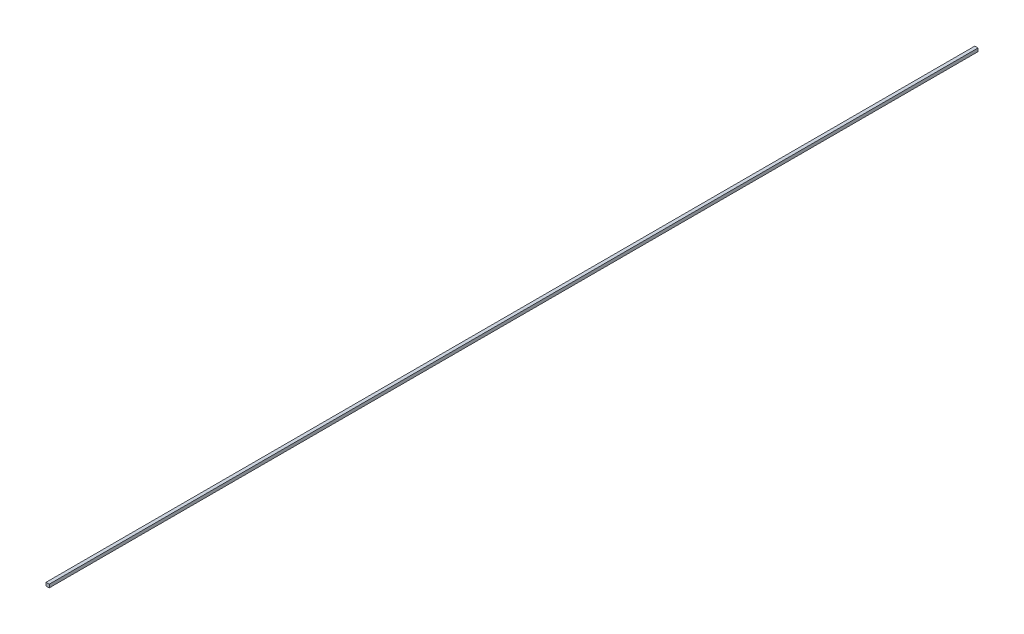
ISO-10303-21;
HEADER;
FILE_DESCRIPTION(('STEP AP214'),'2;1');
FILE_NAME('part.step','',(''),(''),'','','');
FILE_SCHEMA(('AUTOMOTIVE_DESIGN { 1 0 10303 214 1 1 1 1 }'));
ENDSEC;
DATA;
#1=APPLICATION_CONTEXT('core data for automotive mechanical design processes');
#2=APPLICATION_PROTOCOL_DEFINITION('international standard','automotive_design',2000,#1);
#3=PRODUCT_CONTEXT('',#1,'mechanical');
#4=PRODUCT('Part','Part','',(#3));
#5=PRODUCT_RELATED_PRODUCT_CATEGORY('part','',(#4));
#6=PRODUCT_DEFINITION_FORMATION('','',#4);
#7=PRODUCT_DEFINITION_CONTEXT('part definition',#1,'design');
#8=PRODUCT_DEFINITION('design','',#6,#7);
#9=PRODUCT_DEFINITION_SHAPE('','',#8);
#10=(LENGTH_UNIT() NAMED_UNIT(*) SI_UNIT(.MILLI.,.METRE.));
#11=(NAMED_UNIT(*) PLANE_ANGLE_UNIT() SI_UNIT($,.RADIAN.));
#12=(NAMED_UNIT(*) SI_UNIT($,.STERADIAN.) SOLID_ANGLE_UNIT());
#13=UNCERTAINTY_MEASURE_WITH_UNIT(LENGTH_MEASURE(1.E-05),#10,'distance_accuracy_value','');
#14=(GEOMETRIC_REPRESENTATION_CONTEXT(3) GLOBAL_UNCERTAINTY_ASSIGNED_CONTEXT((#13)) GLOBAL_UNIT_ASSIGNED_CONTEXT((#10,
#11,#12)) REPRESENTATION_CONTEXT('',''));
#15=CARTESIAN_POINT('',(0.,0.,0.));
#16=DIRECTION('',(0.,0.,1.));
#17=DIRECTION('',(1.,0.,0.));
#18=AXIS2_PLACEMENT_3D('',#15,#16,#17);
#19=CARTESIAN_POINT('',(0.175,0.175,100.));
#20=DIRECTION('',(-1.,0.,0.));
#21=DIRECTION('',(0.,-1.,0.));
#22=AXIS2_PLACEMENT_3D('',#19,#20,#21);
#23=PLANE('',#22);
#24=DIRECTION('',(0.,1.,0.));
#25=VECTOR('',#24,1.);
#26=CARTESIAN_POINT('',(0.175,0.175,0.));
#27=LINE('',#26,#25);
#28=CARTESIAN_POINT('',(0.175,-0.175,0.));
#29=VERTEX_POINT('',#28);
#30=CARTESIAN_POINT('',(0.175,0.175,0.));
#31=VERTEX_POINT('',#30);
#32=EDGE_CURVE('E98',#29,#31,#27,.T.);
#33=ORIENTED_EDGE('',*,*,#32,.T.);
#34=DIRECTION('',(0.,0.,-1.));
#35=VECTOR('',#34,1.);
#36=CARTESIAN_POINT('',(0.175,0.175,100.));
#37=LINE('',#36,#35);
#38=CARTESIAN_POINT('',(0.175,0.175,100.));
#39=VERTEX_POINT('',#38);
#40=EDGE_CURVE('E11',#39,#31,#37,.T.);
#41=ORIENTED_EDGE('',*,*,#40,.F.);
#42=DIRECTION('',(0.,1.,0.));
#43=VECTOR('',#42,1.);
#44=CARTESIAN_POINT('',(0.175,0.175,100.));
#45=LINE('',#44,#43);
#46=CARTESIAN_POINT('',(0.175,-0.175,100.));
#47=VERTEX_POINT('',#46);
#48=EDGE_CURVE('E86',#47,#39,#45,.T.);
#49=ORIENTED_EDGE('',*,*,#48,.F.);
#50=DIRECTION('',(0.,0.,-1.));
#51=VECTOR('',#50,1.);
#52=CARTESIAN_POINT('',(0.175,-0.175,100.));
#53=LINE('',#52,#51);
#54=EDGE_CURVE('E94',#47,#29,#53,.T.);
#55=ORIENTED_EDGE('',*,*,#54,.T.);
#56=EDGE_LOOP('',(#33,#41,#49,#55));
#57=FACE_BOUND('',#56,.T.);
#58=ADVANCED_FACE('F35',(#57),#23,.F.);
#59=CARTESIAN_POINT('',(-0.175,0.175,100.));
#60=DIRECTION('',(0.,-1.,0.));
#61=DIRECTION('',(0.,0.,-1.));
#62=AXIS2_PLACEMENT_3D('',#59,#60,#61);
#63=PLANE('',#62);
#64=DIRECTION('',(-1.,0.,0.));
#65=VECTOR('',#64,1.);
#66=CARTESIAN_POINT('',(-0.175,0.175,0.));
#67=LINE('',#66,#65);
#68=CARTESIAN_POINT('',(-0.175,0.175,0.));
#69=VERTEX_POINT('',#68);
#70=EDGE_CURVE('E90',#31,#69,#67,.T.);
#71=ORIENTED_EDGE('',*,*,#70,.T.);
#72=DIRECTION('',(0.,0.,-1.));
#73=VECTOR('',#72,1.);
#74=CARTESIAN_POINT('',(-0.175,0.175,100.));
#75=LINE('',#74,#73);
#76=CARTESIAN_POINT('',(-0.175,0.175,100.));
#77=VERTEX_POINT('',#76);
#78=EDGE_CURVE('E43',#77,#69,#75,.T.);
#79=ORIENTED_EDGE('',*,*,#78,.F.);
#80=DIRECTION('',(-1.,0.,0.));
#81=VECTOR('',#80,1.);
#82=CARTESIAN_POINT('',(-0.175,0.175,100.));
#83=LINE('',#82,#81);
#84=EDGE_CURVE('E81',#39,#77,#83,.T.);
#85=ORIENTED_EDGE('',*,*,#84,.F.);
#86=ORIENTED_EDGE('',*,*,#40,.T.);
#87=EDGE_LOOP('',(#71,#79,#85,#86));
#88=FACE_BOUND('',#87,.T.);
#89=ADVANCED_FACE('F89',(#88),#63,.F.);
#90=CARTESIAN_POINT('',(-0.175,0.175,100.));
#91=DIRECTION('',(1.,0.,0.));
#92=DIRECTION('',(0.,1.,0.));
#93=AXIS2_PLACEMENT_3D('',#90,#91,#92);
#94=PLANE('',#93);
#95=DIRECTION('',(0.,-1.,0.));
#96=VECTOR('',#95,1.);
#97=CARTESIAN_POINT('',(-0.175,0.175,0.));
#98=LINE('',#97,#96);
#99=CARTESIAN_POINT('',(-0.175,-0.175,0.));
#100=VERTEX_POINT('',#99);
#101=EDGE_CURVE('E68',#69,#100,#98,.T.);
#102=ORIENTED_EDGE('',*,*,#101,.T.);
#103=DIRECTION('',(0.,0.,-1.));
#104=VECTOR('',#103,1.);
#105=CARTESIAN_POINT('',(-0.175,-0.175,100.));
#106=LINE('',#105,#104);
#107=CARTESIAN_POINT('',(-0.175,-0.175,100.));
#108=VERTEX_POINT('',#107);
#109=EDGE_CURVE('E91',#108,#100,#106,.T.);
#110=ORIENTED_EDGE('',*,*,#109,.F.);
#111=DIRECTION('',(0.,-1.,0.));
#112=VECTOR('',#111,1.);
#113=CARTESIAN_POINT('',(-0.175,0.175,100.));
#114=LINE('',#113,#112);
#115=EDGE_CURVE('E84',#77,#108,#114,.T.);
#116=ORIENTED_EDGE('',*,*,#115,.F.);
#117=ORIENTED_EDGE('',*,*,#78,.T.);
#118=EDGE_LOOP('',(#102,#110,#116,#117));
#119=FACE_BOUND('',#118,.T.);
#120=ADVANCED_FACE('F92',(#119),#94,.F.);
#121=CARTESIAN_POINT('',(-0.175,-0.175,100.));
#122=DIRECTION('',(0.,1.,0.));
#123=DIRECTION('',(-1.,0.,0.));
#124=AXIS2_PLACEMENT_3D('',#121,#122,#123);
#125=PLANE('',#124);
#126=DIRECTION('',(1.,0.,0.));
#127=VECTOR('',#126,1.);
#128=CARTESIAN_POINT('',(-0.175,-0.175,0.));
#129=LINE('',#128,#127);
#130=EDGE_CURVE('E74',#100,#29,#129,.T.);
#131=ORIENTED_EDGE('',*,*,#130,.T.);
#132=ORIENTED_EDGE('',*,*,#54,.F.);
#133=DIRECTION('',(1.,0.,0.));
#134=VECTOR('',#133,1.);
#135=CARTESIAN_POINT('',(-0.175,-0.175,100.));
#136=LINE('',#135,#134);
#137=EDGE_CURVE('E51',#108,#47,#136,.T.);
#138=ORIENTED_EDGE('',*,*,#137,.F.);
#139=ORIENTED_EDGE('',*,*,#109,.T.);
#140=EDGE_LOOP('',(#131,#132,#138,#139));
#141=FACE_BOUND('',#140,.T.);
#142=ADVANCED_FACE('F105',(#141),#125,.F.);
#143=CARTESIAN_POINT('',(0.,0.,100.));
#144=DIRECTION('',(0.,0.,1.));
#145=DIRECTION('',(1.,0.,0.));
#146=AXIS2_PLACEMENT_3D('',#143,#144,#145);
#147=PLANE('',#146);
#148=ORIENTED_EDGE('',*,*,#48,.T.);
#149=ORIENTED_EDGE('',*,*,#84,.T.);
#150=ORIENTED_EDGE('',*,*,#115,.T.);
#151=ORIENTED_EDGE('',*,*,#137,.T.);
#152=EDGE_LOOP('',(#148,#149,#150,#151));
#153=FACE_BOUND('',#152,.T.);
#154=ADVANCED_FACE('F82',(#153),#147,.T.);
#155=CARTESIAN_POINT('',(0.,0.,0.));
#156=DIRECTION('',(0.,0.,1.));
#157=DIRECTION('',(1.,0.,0.));
#158=AXIS2_PLACEMENT_3D('',#155,#156,#157);
#159=PLANE('',#158);
#160=ORIENTED_EDGE('',*,*,#32,.F.);
#161=ORIENTED_EDGE('',*,*,#130,.F.);
#162=ORIENTED_EDGE('',*,*,#101,.F.);
#163=ORIENTED_EDGE('',*,*,#70,.F.);
#164=EDGE_LOOP('',(#160,#161,#162,#163));
#165=FACE_BOUND('',#164,.T.);
#166=ADVANCED_FACE('F108',(#165),#159,.F.);
#167=CLOSED_SHELL('',(#58,#89,#120,#142,#154,#166));
#168=MANIFOLD_SOLID_BREP('B2',#167);
#169=ADVANCED_BREP_SHAPE_REPRESENTATION('',(#18,#168),#14);
#170=SHAPE_DEFINITION_REPRESENTATION(#9,#169);
ENDSEC;
END-ISO-10303-21;
